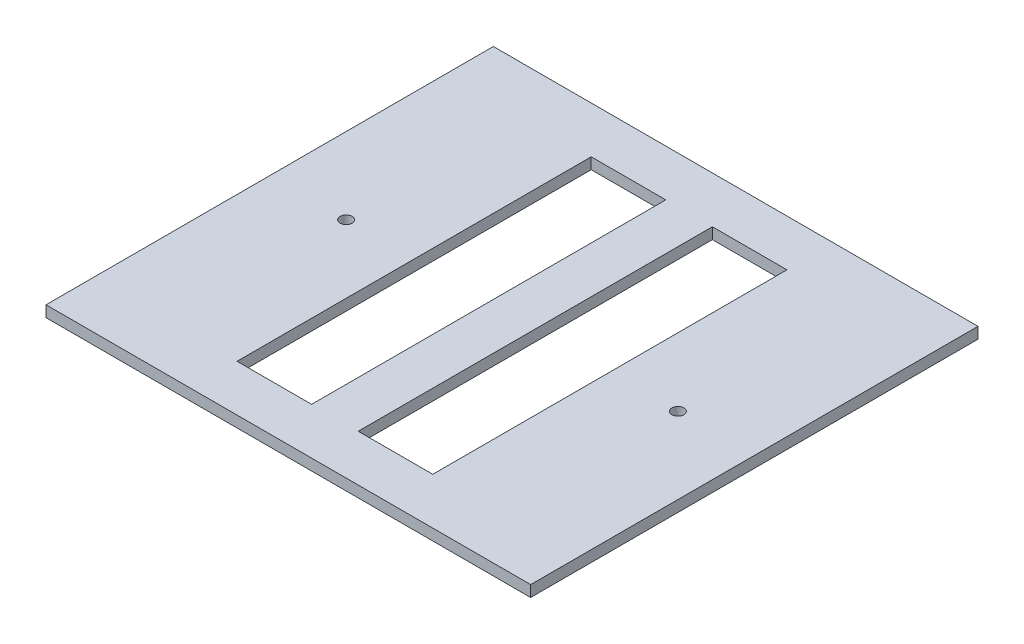
ISO-10303-21;
HEADER;
FILE_DESCRIPTION(('STEP AP214'),'2;1');
FILE_NAME('part.step','',(''),(''),'','','');
FILE_SCHEMA(('AUTOMOTIVE_DESIGN { 1 0 10303 214 1 1 1 1 }'));
ENDSEC;
DATA;
#1=APPLICATION_CONTEXT('core data for automotive mechanical design processes');
#2=APPLICATION_PROTOCOL_DEFINITION('international standard','automotive_design',2000,#1);
#3=PRODUCT_CONTEXT('',#1,'mechanical');
#4=PRODUCT('Part','Part','',(#3));
#5=PRODUCT_RELATED_PRODUCT_CATEGORY('part','',(#4));
#6=PRODUCT_DEFINITION_FORMATION('','',#4);
#7=PRODUCT_DEFINITION_CONTEXT('part definition',#1,'design');
#8=PRODUCT_DEFINITION('design','',#6,#7);
#9=PRODUCT_DEFINITION_SHAPE('','',#8);
#10=(LENGTH_UNIT() NAMED_UNIT(*) SI_UNIT(.MILLI.,.METRE.));
#11=(NAMED_UNIT(*) PLANE_ANGLE_UNIT() SI_UNIT($,.RADIAN.));
#12=(NAMED_UNIT(*) SI_UNIT($,.STERADIAN.) SOLID_ANGLE_UNIT());
#13=UNCERTAINTY_MEASURE_WITH_UNIT(LENGTH_MEASURE(1.E-05),#10,'distance_accuracy_value','');
#14=(GEOMETRIC_REPRESENTATION_CONTEXT(3) GLOBAL_UNCERTAINTY_ASSIGNED_CONTEXT((#13)) GLOBAL_UNIT_ASSIGNED_CONTEXT((#10,
#11,#12)) REPRESENTATION_CONTEXT('',''));
#15=CARTESIAN_POINT('',(0.,0.,0.));
#16=DIRECTION('',(0.,0.,1.));
#17=DIRECTION('',(1.,0.,0.));
#18=AXIS2_PLACEMENT_3D('',#15,#16,#17);
#19=CARTESIAN_POINT('',(0.,3.,0.));
#20=DIRECTION('',(0.,-1.,0.));
#21=DIRECTION('',(0.,0.,-1.));
#22=AXIS2_PLACEMENT_3D('',#19,#20,#21);
#23=PLANE('',#22);
#24=CARTESIAN_POINT('',(-44.5,3.,0.));
#25=DIRECTION('',(0.,-1.,0.));
#26=DIRECTION('',(0.,0.,-1.));
#27=AXIS2_PLACEMENT_3D('',#24,#25,#26);
#28=CIRCLE('',#27,1.6);
#29=CARTESIAN_POINT('',(-44.5,3.,-1.6));
#30=VERTEX_POINT('',#29);
#31=EDGE_CURVE('E313',#30,#30,#28,.F.);
#32=ORIENTED_EDGE('',*,*,#31,.F.);
#33=EDGE_LOOP('',(#32));
#34=FACE_BOUND('',#33,.T.);
#35=CARTESIAN_POINT('',(44.5,3.,0.));
#36=DIRECTION('',(0.,-1.,0.));
#37=DIRECTION('',(0.,0.,-1.));
#38=AXIS2_PLACEMENT_3D('',#35,#36,#37);
#39=CIRCLE('',#38,1.6);
#40=CARTESIAN_POINT('',(44.5,3.,-1.6));
#41=VERTEX_POINT('',#40);
#42=EDGE_CURVE('E138',#41,#41,#39,.T.);
#43=ORIENTED_EDGE('',*,*,#42,.T.);
#44=EDGE_LOOP('',(#43));
#45=FACE_BOUND('',#44,.T.);
#46=DIRECTION('',(0.,0.,-1.));
#47=VECTOR('',#46,1.);
#48=CARTESIAN_POINT('',(65.,3.,60.));
#49=LINE('',#48,#47);
#50=CARTESIAN_POINT('',(65.,3.,60.));
#51=VERTEX_POINT('',#50);
#52=CARTESIAN_POINT('',(65.,3.,-60.));
#53=VERTEX_POINT('',#52);
#54=EDGE_CURVE('E196',#51,#53,#49,.T.);
#55=ORIENTED_EDGE('',*,*,#54,.T.);
#56=DIRECTION('',(-1.,0.,0.));
#57=VECTOR('',#56,1.);
#58=CARTESIAN_POINT('',(-65.,3.,-60.));
#59=LINE('',#58,#57);
#60=CARTESIAN_POINT('',(-65.,3.,-60.));
#61=VERTEX_POINT('',#60);
#62=EDGE_CURVE('E199',#53,#61,#59,.T.);
#63=ORIENTED_EDGE('',*,*,#62,.T.);
#64=DIRECTION('',(0.,0.,1.));
#65=VECTOR('',#64,1.);
#66=CARTESIAN_POINT('',(-65.,3.,60.));
#67=LINE('',#66,#65);
#68=CARTESIAN_POINT('',(-65.,3.,60.));
#69=VERTEX_POINT('',#68);
#70=EDGE_CURVE('E202',#61,#69,#67,.T.);
#71=ORIENTED_EDGE('',*,*,#70,.T.);
#72=DIRECTION('',(1.,0.,0.));
#73=VECTOR('',#72,1.);
#74=CARTESIAN_POINT('',(-65.,3.,60.));
#75=LINE('',#74,#73);
#76=EDGE_CURVE('E204',#69,#51,#75,.T.);
#77=ORIENTED_EDGE('',*,*,#76,.T.);
#78=EDGE_LOOP('',(#55,#63,#71,#77));
#79=FACE_BOUND('',#78,.T.);
#80=DIRECTION('',(1.,0.,0.));
#81=VECTOR('',#80,1.);
#82=CARTESIAN_POINT('',(0.,3.,-47.5));
#83=LINE('',#82,#81);
#84=CARTESIAN_POINT('',(-26.25,3.,-47.5));
#85=VERTEX_POINT('',#84);
#86=CARTESIAN_POINT('',(-6.25,3.,-47.5));
#87=VERTEX_POINT('',#86);
#88=EDGE_CURVE('E176',#85,#87,#83,.T.);
#89=ORIENTED_EDGE('',*,*,#88,.T.);
#90=DIRECTION('',(0.,0.,1.));
#91=VECTOR('',#90,1.);
#92=CARTESIAN_POINT('',(-6.25,3.,0.));
#93=LINE('',#92,#91);
#94=CARTESIAN_POINT('',(-6.25,3.,47.5));
#95=VERTEX_POINT('',#94);
#96=EDGE_CURVE('E192',#87,#95,#93,.T.);
#97=ORIENTED_EDGE('',*,*,#96,.T.);
#98=DIRECTION('',(-1.,0.,0.));
#99=VECTOR('',#98,1.);
#100=CARTESIAN_POINT('',(0.,3.,47.5));
#101=LINE('',#100,#99);
#102=CARTESIAN_POINT('',(-26.25,3.,47.5));
#103=VERTEX_POINT('',#102);
#104=EDGE_CURVE('E189',#95,#103,#101,.T.);
#105=ORIENTED_EDGE('',*,*,#104,.T.);
#106=DIRECTION('',(0.,0.,-1.));
#107=VECTOR('',#106,1.);
#108=CARTESIAN_POINT('',(-26.25,3.,0.));
#109=LINE('',#108,#107);
#110=EDGE_CURVE('E186',#103,#85,#109,.T.);
#111=ORIENTED_EDGE('',*,*,#110,.T.);
#112=EDGE_LOOP('',(#89,#97,#105,#111));
#113=FACE_BOUND('',#112,.T.);
#114=DIRECTION('',(0.,0.,1.));
#115=VECTOR('',#114,1.);
#116=CARTESIAN_POINT('',(6.25,3.,0.));
#117=LINE('',#116,#115);
#118=CARTESIAN_POINT('',(6.25,3.,-47.5));
#119=VERTEX_POINT('',#118);
#120=CARTESIAN_POINT('',(6.25,3.,47.5));
#121=VERTEX_POINT('',#120);
#122=EDGE_CURVE('E132',#119,#121,#117,.T.);
#123=ORIENTED_EDGE('',*,*,#122,.F.);
#124=DIRECTION('',(-1.,0.,0.));
#125=VECTOR('',#124,1.);
#126=CARTESIAN_POINT('',(0.,3.,-47.5));
#127=LINE('',#126,#125);
#128=CARTESIAN_POINT('',(26.25,3.,-47.5));
#129=VERTEX_POINT('',#128);
#130=EDGE_CURVE('E157',#129,#119,#127,.T.);
#131=ORIENTED_EDGE('',*,*,#130,.F.);
#132=DIRECTION('',(0.,0.,-1.));
#133=VECTOR('',#132,1.);
#134=CARTESIAN_POINT('',(26.25,3.,0.));
#135=LINE('',#134,#133);
#136=CARTESIAN_POINT('',(26.25,3.,47.5));
#137=VERTEX_POINT('',#136);
#138=EDGE_CURVE('E155',#137,#129,#135,.T.);
#139=ORIENTED_EDGE('',*,*,#138,.F.);
#140=DIRECTION('',(1.,0.,0.));
#141=VECTOR('',#140,1.);
#142=CARTESIAN_POINT('',(0.,3.,47.5));
#143=LINE('',#142,#141);
#144=EDGE_CURVE('E149',#121,#137,#143,.T.);
#145=ORIENTED_EDGE('',*,*,#144,.F.);
#146=EDGE_LOOP('',(#123,#131,#139,#145));
#147=FACE_BOUND('',#146,.T.);
#148=ADVANCED_FACE('F33',(#34,#45,#79,#113,#147),#23,.F.);
#149=CARTESIAN_POINT('',(0.,0.,0.));
#150=DIRECTION('',(0.,-1.,0.));
#151=DIRECTION('',(0.,0.,-1.));
#152=AXIS2_PLACEMENT_3D('',#149,#150,#151);
#153=PLANE('',#152);
#154=CARTESIAN_POINT('',(-44.5,0.,0.));
#155=DIRECTION('',(0.,-1.,0.));
#156=DIRECTION('',(0.,0.,1.));
#157=AXIS2_PLACEMENT_3D('',#154,#155,#156);
#158=CIRCLE('',#157,1.6);
#159=CARTESIAN_POINT('',(-44.5,0.,1.6));
#160=VERTEX_POINT('',#159);
#161=EDGE_CURVE('E311',#160,#160,#158,.T.);
#162=ORIENTED_EDGE('',*,*,#161,.F.);
#163=EDGE_LOOP('',(#162));
#164=FACE_BOUND('',#163,.T.);
#165=CARTESIAN_POINT('',(44.5,0.,0.));
#166=DIRECTION('',(0.,1.,0.));
#167=DIRECTION('',(0.,0.,1.));
#168=AXIS2_PLACEMENT_3D('',#165,#166,#167);
#169=CIRCLE('',#168,1.6);
#170=CARTESIAN_POINT('',(44.5,0.,1.6));
#171=VERTEX_POINT('',#170);
#172=EDGE_CURVE('E141',#171,#171,#169,.T.);
#173=ORIENTED_EDGE('',*,*,#172,.T.);
#174=EDGE_LOOP('',(#173));
#175=FACE_BOUND('',#174,.T.);
#176=DIRECTION('',(0.,0.,-1.));
#177=VECTOR('',#176,1.);
#178=CARTESIAN_POINT('',(-6.25,0.,47.5));
#179=LINE('',#178,#177);
#180=CARTESIAN_POINT('',(-6.25,0.,47.5));
#181=VERTEX_POINT('',#180);
#182=CARTESIAN_POINT('',(-6.25,0.,-47.5));
#183=VERTEX_POINT('',#182);
#184=EDGE_CURVE('E160',#181,#183,#179,.T.);
#185=ORIENTED_EDGE('',*,*,#184,.T.);
#186=DIRECTION('',(-1.,0.,0.));
#187=VECTOR('',#186,1.);
#188=CARTESIAN_POINT('',(-26.25,0.,-47.5));
#189=LINE('',#188,#187);
#190=CARTESIAN_POINT('',(-26.25,0.,-47.5));
#191=VERTEX_POINT('',#190);
#192=EDGE_CURVE('E163',#183,#191,#189,.T.);
#193=ORIENTED_EDGE('',*,*,#192,.T.);
#194=DIRECTION('',(0.,0.,1.));
#195=VECTOR('',#194,1.);
#196=CARTESIAN_POINT('',(-26.25,0.,47.5));
#197=LINE('',#196,#195);
#198=CARTESIAN_POINT('',(-26.25,0.,47.5));
#199=VERTEX_POINT('',#198);
#200=EDGE_CURVE('E166',#191,#199,#197,.T.);
#201=ORIENTED_EDGE('',*,*,#200,.T.);
#202=DIRECTION('',(1.,0.,0.));
#203=VECTOR('',#202,1.);
#204=CARTESIAN_POINT('',(-26.25,0.,47.5));
#205=LINE('',#204,#203);
#206=EDGE_CURVE('E169',#199,#181,#205,.T.);
#207=ORIENTED_EDGE('',*,*,#206,.T.);
#208=EDGE_LOOP('',(#185,#193,#201,#207));
#209=FACE_BOUND('',#208,.T.);
#210=DIRECTION('',(0.,0.,-1.));
#211=VECTOR('',#210,1.);
#212=CARTESIAN_POINT('',(65.,0.,60.));
#213=LINE('',#212,#211);
#214=CARTESIAN_POINT('',(65.,0.,60.));
#215=VERTEX_POINT('',#214);
#216=CARTESIAN_POINT('',(65.,0.,-60.));
#217=VERTEX_POINT('',#216);
#218=EDGE_CURVE('E195',#215,#217,#213,.T.);
#219=ORIENTED_EDGE('',*,*,#218,.F.);
#220=DIRECTION('',(1.,0.,0.));
#221=VECTOR('',#220,1.);
#222=CARTESIAN_POINT('',(-65.,0.,60.));
#223=LINE('',#222,#221);
#224=CARTESIAN_POINT('',(-65.,0.,60.));
#225=VERTEX_POINT('',#224);
#226=EDGE_CURVE('E200',#225,#215,#223,.T.);
#227=ORIENTED_EDGE('',*,*,#226,.F.);
#228=DIRECTION('',(0.,0.,1.));
#229=VECTOR('',#228,1.);
#230=CARTESIAN_POINT('',(-65.,0.,60.));
#231=LINE('',#230,#229);
#232=CARTESIAN_POINT('',(-65.,0.,-60.));
#233=VERTEX_POINT('',#232);
#234=EDGE_CURVE('E211',#233,#225,#231,.T.);
#235=ORIENTED_EDGE('',*,*,#234,.F.);
#236=DIRECTION('',(-1.,0.,0.));
#237=VECTOR('',#236,1.);
#238=CARTESIAN_POINT('',(-65.,0.,-60.));
#239=LINE('',#238,#237);
#240=EDGE_CURVE('E209',#217,#233,#239,.T.);
#241=ORIENTED_EDGE('',*,*,#240,.F.);
#242=EDGE_LOOP('',(#219,#227,#235,#241));
#243=FACE_BOUND('',#242,.T.);
#244=DIRECTION('',(1.,0.,0.));
#245=VECTOR('',#244,1.);
#246=CARTESIAN_POINT('',(26.25,0.,-47.5));
#247=LINE('',#246,#245);
#248=CARTESIAN_POINT('',(6.25,0.,-47.5));
#249=VERTEX_POINT('',#248);
#250=CARTESIAN_POINT('',(26.25,0.,-47.5));
#251=VERTEX_POINT('',#250);
#252=EDGE_CURVE('E134',#249,#251,#247,.T.);
#253=ORIENTED_EDGE('',*,*,#252,.F.);
#254=DIRECTION('',(0.,0.,-1.));
#255=VECTOR('',#254,1.);
#256=CARTESIAN_POINT('',(6.25,0.,47.5));
#257=LINE('',#256,#255);
#258=CARTESIAN_POINT('',(6.25,0.,47.5));
#259=VERTEX_POINT('',#258);
#260=EDGE_CURVE('E125',#259,#249,#257,.T.);
#261=ORIENTED_EDGE('',*,*,#260,.F.);
#262=DIRECTION('',(-1.,0.,0.));
#263=VECTOR('',#262,1.);
#264=CARTESIAN_POINT('',(26.25,0.,47.5));
#265=LINE('',#264,#263);
#266=CARTESIAN_POINT('',(26.25,0.,47.5));
#267=VERTEX_POINT('',#266);
#268=EDGE_CURVE('E119',#267,#259,#265,.T.);
#269=ORIENTED_EDGE('',*,*,#268,.F.);
#270=DIRECTION('',(0.,0.,1.));
#271=VECTOR('',#270,1.);
#272=CARTESIAN_POINT('',(26.25,0.,47.5));
#273=LINE('',#272,#271);
#274=EDGE_CURVE('E124',#251,#267,#273,.T.);
#275=ORIENTED_EDGE('',*,*,#274,.F.);
#276=EDGE_LOOP('',(#253,#261,#269,#275));
#277=FACE_BOUND('',#276,.T.);
#278=ADVANCED_FACE('F137',(#164,#175,#209,#243,#277),#153,.T.);
#279=CARTESIAN_POINT('',(65.,3.,60.));
#280=DIRECTION('',(-1.,0.,0.));
#281=DIRECTION('',(0.,0.,1.));
#282=AXIS2_PLACEMENT_3D('',#279,#280,#281);
#283=PLANE('',#282);
#284=ORIENTED_EDGE('',*,*,#218,.T.);
#285=DIRECTION('',(0.,-1.,0.));
#286=VECTOR('',#285,1.);
#287=CARTESIAN_POINT('',(65.,3.,-60.));
#288=LINE('',#287,#286);
#289=EDGE_CURVE('E11',#53,#217,#288,.T.);
#290=ORIENTED_EDGE('',*,*,#289,.F.);
#291=ORIENTED_EDGE('',*,*,#54,.F.);
#292=DIRECTION('',(0.,-1.,0.));
#293=VECTOR('',#292,1.);
#294=CARTESIAN_POINT('',(65.,3.,60.));
#295=LINE('',#294,#293);
#296=EDGE_CURVE('E206',#51,#215,#295,.T.);
#297=ORIENTED_EDGE('',*,*,#296,.T.);
#298=EDGE_LOOP('',(#284,#290,#291,#297));
#299=FACE_BOUND('',#298,.T.);
#300=ADVANCED_FACE('F35',(#299),#283,.F.);
#301=CARTESIAN_POINT('',(-65.,3.,-60.));
#302=DIRECTION('',(0.,0.,1.));
#303=DIRECTION('',(1.,0.,0.));
#304=AXIS2_PLACEMENT_3D('',#301,#302,#303);
#305=PLANE('',#304);
#306=ORIENTED_EDGE('',*,*,#240,.T.);
#307=DIRECTION('',(0.,-1.,0.));
#308=VECTOR('',#307,1.);
#309=CARTESIAN_POINT('',(-65.,3.,-60.));
#310=LINE('',#309,#308);
#311=EDGE_CURVE('E41',#61,#233,#310,.T.);
#312=ORIENTED_EDGE('',*,*,#311,.F.);
#313=ORIENTED_EDGE('',*,*,#62,.F.);
#314=ORIENTED_EDGE('',*,*,#289,.T.);
#315=EDGE_LOOP('',(#306,#312,#313,#314));
#316=FACE_BOUND('',#315,.T.);
#317=ADVANCED_FACE('F238',(#316),#305,.F.);
#318=CARTESIAN_POINT('',(-65.,3.,60.));
#319=DIRECTION('',(1.,0.,0.));
#320=DIRECTION('',(0.,0.,-1.));
#321=AXIS2_PLACEMENT_3D('',#318,#319,#320);
#322=PLANE('',#321);
#323=ORIENTED_EDGE('',*,*,#234,.T.);
#324=DIRECTION('',(0.,-1.,0.));
#325=VECTOR('',#324,1.);
#326=CARTESIAN_POINT('',(-65.,3.,60.));
#327=LINE('',#326,#325);
#328=EDGE_CURVE('E216',#69,#225,#327,.T.);
#329=ORIENTED_EDGE('',*,*,#328,.F.);
#330=ORIENTED_EDGE('',*,*,#70,.F.);
#331=ORIENTED_EDGE('',*,*,#311,.T.);
#332=EDGE_LOOP('',(#323,#329,#330,#331));
#333=FACE_BOUND('',#332,.T.);
#334=ADVANCED_FACE('F223',(#333),#322,.F.);
#335=CARTESIAN_POINT('',(-65.,3.,60.));
#336=DIRECTION('',(0.,0.,-1.));
#337=DIRECTION('',(-1.,0.,0.));
#338=AXIS2_PLACEMENT_3D('',#335,#336,#337);
#339=PLANE('',#338);
#340=ORIENTED_EDGE('',*,*,#226,.T.);
#341=ORIENTED_EDGE('',*,*,#296,.F.);
#342=ORIENTED_EDGE('',*,*,#76,.F.);
#343=ORIENTED_EDGE('',*,*,#328,.T.);
#344=EDGE_LOOP('',(#340,#341,#342,#343));
#345=FACE_BOUND('',#344,.T.);
#346=ADVANCED_FACE('F231',(#345),#339,.F.);
#347=CARTESIAN_POINT('',(-6.25,0.,47.5));
#348=DIRECTION('',(1.,0.,0.));
#349=DIRECTION('',(0.,0.,-1.));
#350=AXIS2_PLACEMENT_3D('',#347,#348,#349);
#351=PLANE('',#350);
#352=DIRECTION('',(0.,1.,0.));
#353=VECTOR('',#352,1.);
#354=CARTESIAN_POINT('',(-6.25,0.,-47.5));
#355=LINE('',#354,#353);
#356=EDGE_CURVE('E172',#183,#87,#355,.T.);
#357=ORIENTED_EDGE('',*,*,#356,.F.);
#358=ORIENTED_EDGE('',*,*,#184,.F.);
#359=DIRECTION('',(0.,1.,0.));
#360=VECTOR('',#359,1.);
#361=CARTESIAN_POINT('',(-6.25,0.,47.5));
#362=LINE('',#361,#360);
#363=EDGE_CURVE('E173',#181,#95,#362,.T.);
#364=ORIENTED_EDGE('',*,*,#363,.T.);
#365=ORIENTED_EDGE('',*,*,#96,.F.);
#366=EDGE_LOOP('',(#357,#358,#364,#365));
#367=FACE_BOUND('',#366,.T.);
#368=ADVANCED_FACE('F256',(#367),#351,.F.);
#369=CARTESIAN_POINT('',(-26.25,0.,47.5));
#370=DIRECTION('',(0.,0.,1.));
#371=DIRECTION('',(1.,0.,0.));
#372=AXIS2_PLACEMENT_3D('',#369,#370,#371);
#373=PLANE('',#372);
#374=ORIENTED_EDGE('',*,*,#363,.F.);
#375=ORIENTED_EDGE('',*,*,#206,.F.);
#376=DIRECTION('',(0.,1.,0.));
#377=VECTOR('',#376,1.);
#378=CARTESIAN_POINT('',(-26.25,0.,47.5));
#379=LINE('',#378,#377);
#380=EDGE_CURVE('E177',#199,#103,#379,.T.);
#381=ORIENTED_EDGE('',*,*,#380,.T.);
#382=ORIENTED_EDGE('',*,*,#104,.F.);
#383=EDGE_LOOP('',(#374,#375,#381,#382));
#384=FACE_BOUND('',#383,.T.);
#385=ADVANCED_FACE('F263',(#384),#373,.F.);
#386=CARTESIAN_POINT('',(-26.25,0.,47.5));
#387=DIRECTION('',(-1.,0.,0.));
#388=DIRECTION('',(0.,0.,1.));
#389=AXIS2_PLACEMENT_3D('',#386,#387,#388);
#390=PLANE('',#389);
#391=ORIENTED_EDGE('',*,*,#380,.F.);
#392=ORIENTED_EDGE('',*,*,#200,.F.);
#393=DIRECTION('',(0.,1.,0.));
#394=VECTOR('',#393,1.);
#395=CARTESIAN_POINT('',(-26.25,0.,-47.5));
#396=LINE('',#395,#394);
#397=EDGE_CURVE('E180',#191,#85,#396,.T.);
#398=ORIENTED_EDGE('',*,*,#397,.T.);
#399=ORIENTED_EDGE('',*,*,#110,.F.);
#400=EDGE_LOOP('',(#391,#392,#398,#399));
#401=FACE_BOUND('',#400,.T.);
#402=ADVANCED_FACE('F268',(#401),#390,.F.);
#403=CARTESIAN_POINT('',(-26.25,0.,-47.5));
#404=DIRECTION('',(0.,0.,-1.));
#405=DIRECTION('',(-1.,0.,0.));
#406=AXIS2_PLACEMENT_3D('',#403,#404,#405);
#407=PLANE('',#406);
#408=ORIENTED_EDGE('',*,*,#397,.F.);
#409=ORIENTED_EDGE('',*,*,#192,.F.);
#410=ORIENTED_EDGE('',*,*,#356,.T.);
#411=ORIENTED_EDGE('',*,*,#88,.F.);
#412=EDGE_LOOP('',(#408,#409,#410,#411));
#413=FACE_BOUND('',#412,.T.);
#414=ADVANCED_FACE('F276',(#413),#407,.F.);
#415=CARTESIAN_POINT('',(6.25,0.,47.5));
#416=DIRECTION('',(1.,0.,0.));
#417=DIRECTION('',(0.,0.,-1.));
#418=AXIS2_PLACEMENT_3D('',#415,#416,#417);
#419=PLANE('',#418);
#420=ORIENTED_EDGE('',*,*,#122,.T.);
#421=DIRECTION('',(0.,1.,0.));
#422=VECTOR('',#421,1.);
#423=CARTESIAN_POINT('',(6.25,0.,47.5));
#424=LINE('',#423,#422);
#425=EDGE_CURVE('E48',#259,#121,#424,.T.);
#426=ORIENTED_EDGE('',*,*,#425,.F.);
#427=ORIENTED_EDGE('',*,*,#260,.T.);
#428=DIRECTION('',(0.,1.,0.));
#429=VECTOR('',#428,1.);
#430=CARTESIAN_POINT('',(6.25,0.,-47.5));
#431=LINE('',#430,#429);
#432=EDGE_CURVE('E147',#249,#119,#431,.T.);
#433=ORIENTED_EDGE('',*,*,#432,.T.);
#434=EDGE_LOOP('',(#420,#426,#427,#433));
#435=FACE_BOUND('',#434,.T.);
#436=ADVANCED_FACE('F128',(#435),#419,.T.);
#437=CARTESIAN_POINT('',(26.25,0.,-47.5));
#438=DIRECTION('',(0.,0.,1.));
#439=DIRECTION('',(1.,0.,0.));
#440=AXIS2_PLACEMENT_3D('',#437,#438,#439);
#441=PLANE('',#440);
#442=ORIENTED_EDGE('',*,*,#130,.T.);
#443=ORIENTED_EDGE('',*,*,#432,.F.);
#444=ORIENTED_EDGE('',*,*,#252,.T.);
#445=DIRECTION('',(0.,1.,0.));
#446=VECTOR('',#445,1.);
#447=CARTESIAN_POINT('',(26.25,0.,-47.5));
#448=LINE('',#447,#446);
#449=EDGE_CURVE('E150',#251,#129,#448,.T.);
#450=ORIENTED_EDGE('',*,*,#449,.T.);
#451=EDGE_LOOP('',(#442,#443,#444,#450));
#452=FACE_BOUND('',#451,.T.);
#453=ADVANCED_FACE('F289',(#452),#441,.T.);
#454=CARTESIAN_POINT('',(26.25,0.,47.5));
#455=DIRECTION('',(-1.,0.,0.));
#456=DIRECTION('',(0.,0.,1.));
#457=AXIS2_PLACEMENT_3D('',#454,#455,#456);
#458=PLANE('',#457);
#459=ORIENTED_EDGE('',*,*,#138,.T.);
#460=ORIENTED_EDGE('',*,*,#449,.F.);
#461=ORIENTED_EDGE('',*,*,#274,.T.);
#462=DIRECTION('',(0.,1.,0.));
#463=VECTOR('',#462,1.);
#464=CARTESIAN_POINT('',(26.25,0.,47.5));
#465=LINE('',#464,#463);
#466=EDGE_CURVE('E53',#267,#137,#465,.T.);
#467=ORIENTED_EDGE('',*,*,#466,.T.);
#468=EDGE_LOOP('',(#459,#460,#461,#467));
#469=FACE_BOUND('',#468,.T.);
#470=ADVANCED_FACE('F293',(#469),#458,.T.);
#471=CARTESIAN_POINT('',(26.25,0.,47.5));
#472=DIRECTION('',(0.,0.,-1.));
#473=DIRECTION('',(-1.,0.,0.));
#474=AXIS2_PLACEMENT_3D('',#471,#472,#473);
#475=PLANE('',#474);
#476=ORIENTED_EDGE('',*,*,#144,.T.);
#477=ORIENTED_EDGE('',*,*,#466,.F.);
#478=ORIENTED_EDGE('',*,*,#268,.T.);
#479=ORIENTED_EDGE('',*,*,#425,.T.);
#480=EDGE_LOOP('',(#476,#477,#478,#479));
#481=FACE_BOUND('',#480,.T.);
#482=ADVANCED_FACE('F120',(#481),#475,.T.);
#483=CARTESIAN_POINT('',(44.5,0.,0.));
#484=DIRECTION('',(0.,1.,0.));
#485=DIRECTION('',(0.,0.,1.));
#486=AXIS2_PLACEMENT_3D('',#483,#484,#485);
#487=CYLINDRICAL_SURFACE('',#486,1.6);
#488=ORIENTED_EDGE('',*,*,#172,.F.);
#489=EDGE_LOOP('',(#488));
#490=FACE_BOUND('',#489,.T.);
#491=ORIENTED_EDGE('',*,*,#42,.F.);
#492=EDGE_LOOP('',(#491));
#493=FACE_BOUND('',#492,.T.);
#494=ADVANCED_FACE('F292',(#490,#493),#487,.F.);
#495=CARTESIAN_POINT('',(-44.5,0.,0.));
#496=DIRECTION('',(0.,1.,0.));
#497=DIRECTION('',(0.,0.,1.));
#498=AXIS2_PLACEMENT_3D('',#495,#496,#497);
#499=CYLINDRICAL_SURFACE('',#498,1.6);
#500=ORIENTED_EDGE('',*,*,#161,.T.);
#501=EDGE_LOOP('',(#500));
#502=FACE_BOUND('',#501,.T.);
#503=ORIENTED_EDGE('',*,*,#31,.T.);
#504=EDGE_LOOP('',(#503));
#505=FACE_BOUND('',#504,.T.);
#506=ADVANCED_FACE('F302',(#502,#505),#499,.F.);
#507=CLOSED_SHELL('',(#148,#278,#300,#317,#334,#346,#368,#385,#402,#414,#436,#453,#470,#482,
#494,#506));
#508=MANIFOLD_SOLID_BREP('B2',#507);
#509=ADVANCED_BREP_SHAPE_REPRESENTATION('',(#18,#508),#14);
#510=SHAPE_DEFINITION_REPRESENTATION(#9,#509);
ENDSEC;
END-ISO-10303-21;
